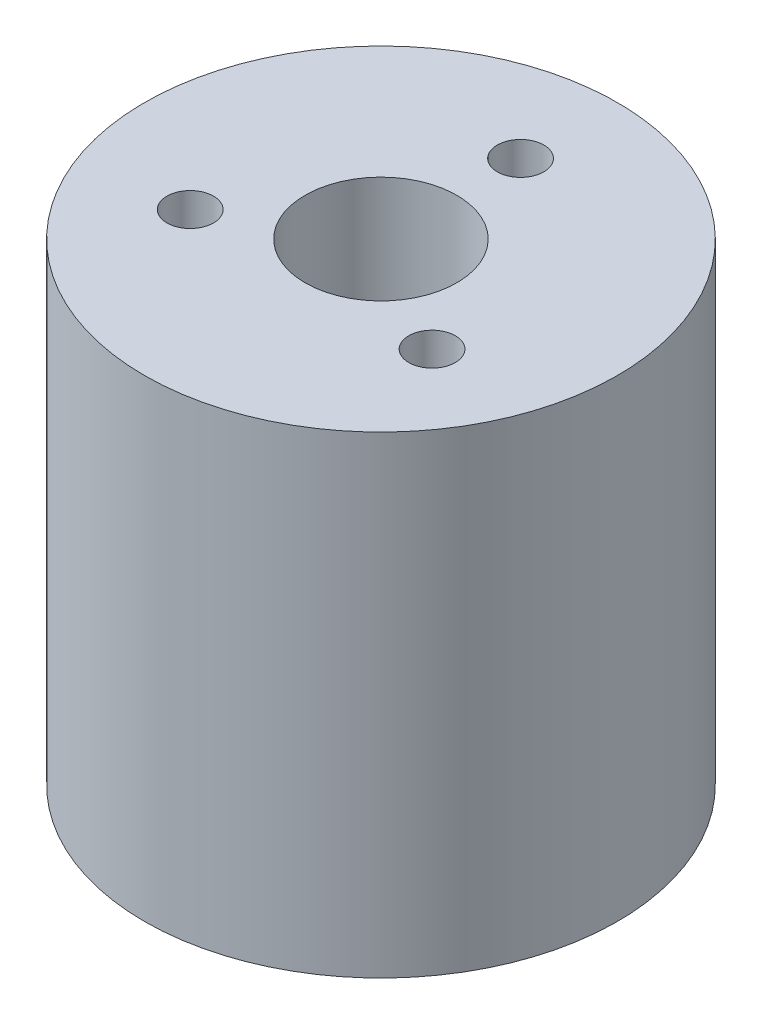
ISO-10303-21;
HEADER;
FILE_DESCRIPTION(('STEP AP214'),'2;1');
FILE_NAME('part.step','',(''),(''),'','','');
FILE_SCHEMA(('AUTOMOTIVE_DESIGN { 1 0 10303 214 1 1 1 1 }'));
ENDSEC;
DATA;
#1=APPLICATION_CONTEXT('core data for automotive mechanical design processes');
#2=APPLICATION_PROTOCOL_DEFINITION('international standard','automotive_design',2000,#1);
#3=PRODUCT_CONTEXT('',#1,'mechanical');
#4=PRODUCT('Part','Part','',(#3));
#5=PRODUCT_RELATED_PRODUCT_CATEGORY('part','',(#4));
#6=PRODUCT_DEFINITION_FORMATION('','',#4);
#7=PRODUCT_DEFINITION_CONTEXT('part definition',#1,'design');
#8=PRODUCT_DEFINITION('design','',#6,#7);
#9=PRODUCT_DEFINITION_SHAPE('','',#8);
#10=(LENGTH_UNIT() NAMED_UNIT(*) SI_UNIT(.MILLI.,.METRE.));
#11=(NAMED_UNIT(*) PLANE_ANGLE_UNIT() SI_UNIT($,.RADIAN.));
#12=(NAMED_UNIT(*) SI_UNIT($,.STERADIAN.) SOLID_ANGLE_UNIT());
#13=UNCERTAINTY_MEASURE_WITH_UNIT(LENGTH_MEASURE(1.E-05),#10,'distance_accuracy_value','');
#14=(GEOMETRIC_REPRESENTATION_CONTEXT(3) GLOBAL_UNCERTAINTY_ASSIGNED_CONTEXT((#13)) GLOBAL_UNIT_ASSIGNED_CONTEXT((#10,
#11,#12)) REPRESENTATION_CONTEXT('',''));
#15=CARTESIAN_POINT('',(0.,0.,0.));
#16=DIRECTION('',(0.,0.,1.));
#17=DIRECTION('',(1.,0.,0.));
#18=AXIS2_PLACEMENT_3D('',#15,#16,#17);
#19=CARTESIAN_POINT('',(0.,25.4,0.));
#20=DIRECTION('',(0.,-1.,0.));
#21=DIRECTION('',(0.,0.,-1.));
#22=AXIS2_PLACEMENT_3D('',#19,#20,#21);
#23=CYLINDRICAL_SURFACE('',#22,12.7);
#24=CARTESIAN_POINT('',(0.,25.4,0.));
#25=DIRECTION('',(0.,1.,0.));
#26=DIRECTION('',(0.,0.,1.));
#27=AXIS2_PLACEMENT_3D('',#24,#25,#26);
#28=CIRCLE('',#27,12.7);
#29=CARTESIAN_POINT('',(0.,25.4,12.7));
#30=VERTEX_POINT('',#29);
#31=EDGE_CURVE('E10',#30,#30,#28,.T.);
#32=ORIENTED_EDGE('',*,*,#31,.F.);
#33=EDGE_LOOP('',(#32));
#34=FACE_BOUND('',#33,.T.);
#35=CARTESIAN_POINT('',(0.,0.,0.));
#36=DIRECTION('',(0.,1.,0.));
#37=DIRECTION('',(0.,0.,1.));
#38=AXIS2_PLACEMENT_3D('',#35,#36,#37);
#39=CIRCLE('',#38,12.7);
#40=CARTESIAN_POINT('',(0.,0.,12.7));
#41=VERTEX_POINT('',#40);
#42=EDGE_CURVE('E34',#41,#41,#39,.T.);
#43=ORIENTED_EDGE('',*,*,#42,.T.);
#44=EDGE_LOOP('',(#43));
#45=FACE_BOUND('',#44,.T.);
#46=ADVANCED_FACE('F31',(#34,#45),#23,.T.);
#47=CARTESIAN_POINT('',(0.,25.4,0.));
#48=DIRECTION('',(0.,1.,0.));
#49=DIRECTION('',(0.,0.,1.));
#50=AXIS2_PLACEMENT_3D('',#47,#48,#49);
#51=PLANE('',#50);
#52=CARTESIAN_POINT('',(-6.49519052838249,25.4,3.75000000000046));
#53=DIRECTION('',(0.,1.,0.));
#54=DIRECTION('',(0.,0.,1.));
#55=AXIS2_PLACEMENT_3D('',#52,#53,#54);
#56=CIRCLE('',#55,1.25);
#57=CARTESIAN_POINT('',(-6.49519052838249,25.4,5.00000000000046));
#58=VERTEX_POINT('',#57);
#59=EDGE_CURVE('E61',#58,#58,#56,.T.);
#60=ORIENTED_EDGE('',*,*,#59,.F.);
#61=EDGE_LOOP('',(#60));
#62=FACE_BOUND('',#61,.T.);
#63=CARTESIAN_POINT('',(6.49519052838409,25.4,3.74999999999954));
#64=DIRECTION('',(0.,1.,0.));
#65=DIRECTION('',(0.,0.,1.));
#66=AXIS2_PLACEMENT_3D('',#63,#64,#65);
#67=CIRCLE('',#66,1.25);
#68=CARTESIAN_POINT('',(6.49519052838409,25.4,4.99999999999954));
#69=VERTEX_POINT('',#68);
#70=EDGE_CURVE('E58',#69,#69,#67,.T.);
#71=ORIENTED_EDGE('',*,*,#70,.F.);
#72=EDGE_LOOP('',(#71));
#73=FACE_BOUND('',#72,.T.);
#74=CARTESIAN_POINT('',(0.,25.4,-7.5));
#75=DIRECTION('',(0.,1.,0.));
#76=DIRECTION('',(0.,0.,1.));
#77=AXIS2_PLACEMENT_3D('',#74,#75,#76);
#78=CIRCLE('',#77,1.25);
#79=CARTESIAN_POINT('',(0.,25.4,-6.25));
#80=VERTEX_POINT('',#79);
#81=EDGE_CURVE('E52',#80,#80,#78,.T.);
#82=ORIENTED_EDGE('',*,*,#81,.F.);
#83=EDGE_LOOP('',(#82));
#84=FACE_BOUND('',#83,.T.);
#85=CARTESIAN_POINT('',(0.,25.4,0.));
#86=DIRECTION('',(0.,1.,0.));
#87=DIRECTION('',(0.,0.,1.));
#88=AXIS2_PLACEMENT_3D('',#85,#86,#87);
#89=CIRCLE('',#88,4.075);
#90=CARTESIAN_POINT('',(0.,25.4,4.075));
#91=VERTEX_POINT('',#90);
#92=EDGE_CURVE('E43',#91,#91,#89,.T.);
#93=ORIENTED_EDGE('',*,*,#92,.F.);
#94=EDGE_LOOP('',(#93));
#95=FACE_BOUND('',#94,.T.);
#96=ORIENTED_EDGE('',*,*,#31,.T.);
#97=EDGE_LOOP('',(#96));
#98=FACE_BOUND('',#97,.T.);
#99=ADVANCED_FACE('F76',(#62,#73,#84,#95,#98),#51,.T.);
#100=CARTESIAN_POINT('',(0.,0.,0.));
#101=DIRECTION('',(0.,1.,0.));
#102=DIRECTION('',(0.,0.,1.));
#103=AXIS2_PLACEMENT_3D('',#100,#101,#102);
#104=PLANE('',#103);
#105=ORIENTED_EDGE('',*,*,#42,.F.);
#106=EDGE_LOOP('',(#105));
#107=FACE_BOUND('',#106,.T.);
#108=ADVANCED_FACE('F79',(#107),#104,.F.);
#109=CARTESIAN_POINT('',(0.,6.35,0.));
#110=DIRECTION('',(0.,1.,0.));
#111=DIRECTION('',(0.,0.,1.));
#112=AXIS2_PLACEMENT_3D('',#109,#110,#111);
#113=CYLINDRICAL_SURFACE('',#112,4.075);
#114=CARTESIAN_POINT('',(0.,6.35,0.));
#115=DIRECTION('',(0.,1.,0.));
#116=DIRECTION('',(0.,0.,1.));
#117=AXIS2_PLACEMENT_3D('',#114,#115,#116);
#118=CIRCLE('',#117,4.075);
#119=CARTESIAN_POINT('',(0.,6.35,4.075));
#120=VERTEX_POINT('',#119);
#121=EDGE_CURVE('E41',#120,#120,#118,.T.);
#122=ORIENTED_EDGE('',*,*,#121,.F.);
#123=EDGE_LOOP('',(#122));
#124=FACE_BOUND('',#123,.T.);
#125=ORIENTED_EDGE('',*,*,#92,.T.);
#126=EDGE_LOOP('',(#125));
#127=FACE_BOUND('',#126,.T.);
#128=ADVANCED_FACE('F87',(#124,#127),#113,.F.);
#129=CARTESIAN_POINT('',(0.,6.35,0.));
#130=DIRECTION('',(0.,1.,0.));
#131=DIRECTION('',(0.,0.,1.));
#132=AXIS2_PLACEMENT_3D('',#129,#130,#131);
#133=PLANE('',#132);
#134=ORIENTED_EDGE('',*,*,#121,.T.);
#135=EDGE_LOOP('',(#134));
#136=FACE_BOUND('',#135,.T.);
#137=ADVANCED_FACE('F89',(#136),#133,.T.);
#138=CARTESIAN_POINT('',(0.,15.4,-7.5));
#139=DIRECTION('',(0.,1.,0.));
#140=DIRECTION('',(0.,0.,1.));
#141=AXIS2_PLACEMENT_3D('',#138,#139,#140);
#142=CYLINDRICAL_SURFACE('',#141,1.25);
#143=CARTESIAN_POINT('',(0.,15.4,-7.5));
#144=DIRECTION('',(0.,1.,0.));
#145=DIRECTION('',(0.,0.,1.));
#146=AXIS2_PLACEMENT_3D('',#143,#144,#145);
#147=CIRCLE('',#146,1.25);
#148=CARTESIAN_POINT('',(0.,15.4,-6.25));
#149=VERTEX_POINT('',#148);
#150=EDGE_CURVE('E49',#149,#149,#147,.T.);
#151=ORIENTED_EDGE('',*,*,#150,.F.);
#152=EDGE_LOOP('',(#151));
#153=FACE_BOUND('',#152,.T.);
#154=ORIENTED_EDGE('',*,*,#81,.T.);
#155=EDGE_LOOP('',(#154));
#156=FACE_BOUND('',#155,.T.);
#157=ADVANCED_FACE('F96',(#153,#156),#142,.F.);
#158=CARTESIAN_POINT('',(0.,15.4,-7.5));
#159=DIRECTION('',(0.,1.,0.));
#160=DIRECTION('',(0.,0.,1.));
#161=AXIS2_PLACEMENT_3D('',#158,#159,#160);
#162=PLANE('',#161);
#163=ORIENTED_EDGE('',*,*,#150,.T.);
#164=EDGE_LOOP('',(#163));
#165=FACE_BOUND('',#164,.T.);
#166=ADVANCED_FACE('F134',(#165),#162,.T.);
#167=CARTESIAN_POINT('',(6.49519052838409,15.4,3.74999999999954));
#168=DIRECTION('',(0.,1.,0.));
#169=DIRECTION('',(0.,0.,1.));
#170=AXIS2_PLACEMENT_3D('',#167,#168,#169);
#171=CYLINDRICAL_SURFACE('',#170,1.25);
#172=CARTESIAN_POINT('',(6.49519052838409,15.4,3.74999999999954));
#173=DIRECTION('',(0.,1.,0.));
#174=DIRECTION('',(0.,0.,1.));
#175=AXIS2_PLACEMENT_3D('',#172,#173,#174);
#176=CIRCLE('',#175,1.25);
#177=CARTESIAN_POINT('',(6.49519052838409,15.4,4.99999999999954));
#178=VERTEX_POINT('',#177);
#179=EDGE_CURVE('E55',#178,#178,#176,.T.);
#180=ORIENTED_EDGE('',*,*,#179,.F.);
#181=EDGE_LOOP('',(#180));
#182=FACE_BOUND('',#181,.T.);
#183=ORIENTED_EDGE('',*,*,#70,.T.);
#184=EDGE_LOOP('',(#183));
#185=FACE_BOUND('',#184,.T.);
#186=ADVANCED_FACE('F141',(#182,#185),#171,.F.);
#187=CARTESIAN_POINT('',(6.49519052838409,15.4,3.74999999999954));
#188=DIRECTION('',(0.,1.,0.));
#189=DIRECTION('',(0.,0.,1.));
#190=AXIS2_PLACEMENT_3D('',#187,#188,#189);
#191=PLANE('',#190);
#192=ORIENTED_EDGE('',*,*,#179,.T.);
#193=EDGE_LOOP('',(#192));
#194=FACE_BOUND('',#193,.T.);
#195=ADVANCED_FACE('F72',(#194),#191,.T.);
#196=CARTESIAN_POINT('',(-6.49519052838249,15.4,3.75000000000046));
#197=DIRECTION('',(0.,1.,0.));
#198=DIRECTION('',(0.,0.,1.));
#199=AXIS2_PLACEMENT_3D('',#196,#197,#198);
#200=CYLINDRICAL_SURFACE('',#199,1.25);
#201=CARTESIAN_POINT('',(-6.49519052838249,15.4,3.75000000000046));
#202=DIRECTION('',(0.,1.,0.));
#203=DIRECTION('',(0.,0.,1.));
#204=AXIS2_PLACEMENT_3D('',#201,#202,#203);
#205=CIRCLE('',#204,1.25);
#206=CARTESIAN_POINT('',(-6.49519052838249,15.4,5.00000000000046));
#207=VERTEX_POINT('',#206);
#208=EDGE_CURVE('E46',#207,#207,#205,.T.);
#209=ORIENTED_EDGE('',*,*,#208,.F.);
#210=EDGE_LOOP('',(#209));
#211=FACE_BOUND('',#210,.T.);
#212=ORIENTED_EDGE('',*,*,#59,.T.);
#213=EDGE_LOOP('',(#212));
#214=FACE_BOUND('',#213,.T.);
#215=ADVANCED_FACE('F69',(#211,#214),#200,.F.);
#216=CARTESIAN_POINT('',(-6.49519052838249,15.4,3.75000000000046));
#217=DIRECTION('',(0.,1.,0.));
#218=DIRECTION('',(0.,0.,1.));
#219=AXIS2_PLACEMENT_3D('',#216,#217,#218);
#220=PLANE('',#219);
#221=ORIENTED_EDGE('',*,*,#208,.T.);
#222=EDGE_LOOP('',(#221));
#223=FACE_BOUND('',#222,.T.);
#224=ADVANCED_FACE('F67',(#223),#220,.T.);
#225=CLOSED_SHELL('',(#46,#99,#108,#128,#137,#157,#166,#186,#195,#215,#224));
#226=MANIFOLD_SOLID_BREP('B2',#225);
#227=ADVANCED_BREP_SHAPE_REPRESENTATION('',(#18,#226),#14);
#228=SHAPE_DEFINITION_REPRESENTATION(#9,#227);
ENDSEC;
END-ISO-10303-21;
